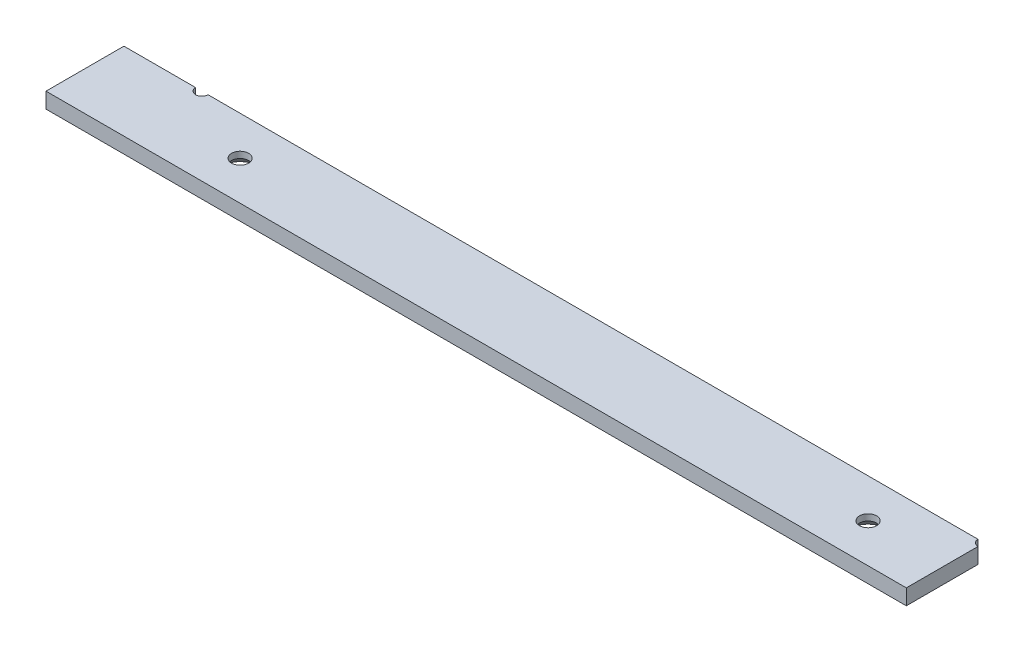
ISO-10303-21;
HEADER;
FILE_DESCRIPTION(('STEP AP214'),'2;1');
FILE_NAME('part.step','',(''),(''),'','','');
FILE_SCHEMA(('AUTOMOTIVE_DESIGN { 1 0 10303 214 1 1 1 1 }'));
ENDSEC;
DATA;
#1=APPLICATION_CONTEXT('core data for automotive mechanical design processes');
#2=APPLICATION_PROTOCOL_DEFINITION('international standard','automotive_design',2000,#1);
#3=PRODUCT_CONTEXT('',#1,'mechanical');
#4=PRODUCT('Part','Part','',(#3));
#5=PRODUCT_RELATED_PRODUCT_CATEGORY('part','',(#4));
#6=PRODUCT_DEFINITION_FORMATION('','',#4);
#7=PRODUCT_DEFINITION_CONTEXT('part definition',#1,'design');
#8=PRODUCT_DEFINITION('design','',#6,#7);
#9=PRODUCT_DEFINITION_SHAPE('','',#8);
#10=(LENGTH_UNIT() NAMED_UNIT(*) SI_UNIT(.MILLI.,.METRE.));
#11=(NAMED_UNIT(*) PLANE_ANGLE_UNIT() SI_UNIT($,.RADIAN.));
#12=(NAMED_UNIT(*) SI_UNIT($,.STERADIAN.) SOLID_ANGLE_UNIT());
#13=UNCERTAINTY_MEASURE_WITH_UNIT(LENGTH_MEASURE(1.E-05),#10,'distance_accuracy_value','');
#14=(GEOMETRIC_REPRESENTATION_CONTEXT(3) GLOBAL_UNCERTAINTY_ASSIGNED_CONTEXT((#13)) GLOBAL_UNIT_ASSIGNED_CONTEXT((#10,
#11,#12)) REPRESENTATION_CONTEXT('',''));
#15=CARTESIAN_POINT('',(0.,0.,0.));
#16=DIRECTION('',(0.,0.,1.));
#17=DIRECTION('',(1.,0.,0.));
#18=AXIS2_PLACEMENT_3D('',#15,#16,#17);
#19=CARTESIAN_POINT('',(0.,5.,-25.));
#20=DIRECTION('',(0.,0.,1.));
#21=DIRECTION('',(1.,0.,0.));
#22=AXIS2_PLACEMENT_3D('',#19,#20,#21);
#23=PLANE('',#22);
#24=DIRECTION('',(-1.,0.,0.));
#25=VECTOR('',#24,1.);
#26=CARTESIAN_POINT('',(0.,0.,-25.));
#27=LINE('',#26,#25);
#28=CARTESIAN_POINT('',(274.,0.,-25.));
#29=VERTEX_POINT('',#28);
#30=CARTESIAN_POINT('',(27.,0.,-25.));
#31=VERTEX_POINT('',#30);
#32=EDGE_CURVE('E110',#29,#31,#27,.T.);
#33=ORIENTED_EDGE('',*,*,#32,.T.);
#34=DIRECTION('',(0.,1.,0.));
#35=VECTOR('',#34,1.);
#36=CARTESIAN_POINT('',(27.,0.,-25.));
#37=LINE('',#36,#35);
#38=CARTESIAN_POINT('',(27.,5.,-25.));
#39=VERTEX_POINT('',#38);
#40=EDGE_CURVE('E48',#31,#39,#37,.T.);
#41=ORIENTED_EDGE('',*,*,#40,.T.);
#42=DIRECTION('',(-1.,0.,0.));
#43=VECTOR('',#42,1.);
#44=CARTESIAN_POINT('',(0.,5.,-25.));
#45=LINE('',#44,#43);
#46=CARTESIAN_POINT('',(274.,5.,-25.));
#47=VERTEX_POINT('',#46);
#48=EDGE_CURVE('E122',#47,#39,#45,.T.);
#49=ORIENTED_EDGE('',*,*,#48,.F.);
#50=DIRECTION('',(0.,1.,0.));
#51=VECTOR('',#50,1.);
#52=CARTESIAN_POINT('',(274.,0.,-25.));
#53=LINE('',#52,#51);
#54=EDGE_CURVE('E129',#47,#29,#53,.F.);
#55=ORIENTED_EDGE('',*,*,#54,.T.);
#56=EDGE_LOOP('',(#33,#41,#49,#55));
#57=FACE_BOUND('',#56,.T.);
#58=ADVANCED_FACE('F34',(#57),#23,.F.);
#59=CARTESIAN_POINT('',(0.,5.,0.));
#60=DIRECTION('',(1.,0.,0.));
#61=DIRECTION('',(0.,0.,-1.));
#62=AXIS2_PLACEMENT_3D('',#59,#60,#61);
#63=PLANE('',#62);
#64=DIRECTION('',(0.,0.,1.));
#65=VECTOR('',#64,1.);
#66=CARTESIAN_POINT('',(0.,0.,0.));
#67=LINE('',#66,#65);
#68=CARTESIAN_POINT('',(0.,0.,-25.));
#69=VERTEX_POINT('',#68);
#70=CARTESIAN_POINT('',(0.,0.,0.));
#71=VERTEX_POINT('',#70);
#72=EDGE_CURVE('E109',#69,#71,#67,.T.);
#73=ORIENTED_EDGE('',*,*,#72,.T.);
#74=DIRECTION('',(0.,-1.,0.));
#75=VECTOR('',#74,1.);
#76=CARTESIAN_POINT('',(0.,5.,0.));
#77=LINE('',#76,#75);
#78=CARTESIAN_POINT('',(0.,5.,0.));
#79=VERTEX_POINT('',#78);
#80=EDGE_CURVE('E125',#79,#71,#77,.T.);
#81=ORIENTED_EDGE('',*,*,#80,.F.);
#82=DIRECTION('',(0.,0.,1.));
#83=VECTOR('',#82,1.);
#84=CARTESIAN_POINT('',(0.,5.,0.));
#85=LINE('',#84,#83);
#86=CARTESIAN_POINT('',(0.,5.,-25.));
#87=VERTEX_POINT('',#86);
#88=EDGE_CURVE('E113',#87,#79,#85,.T.);
#89=ORIENTED_EDGE('',*,*,#88,.F.);
#90=DIRECTION('',(0.,-1.,0.));
#91=VECTOR('',#90,1.);
#92=CARTESIAN_POINT('',(0.,5.,-25.));
#93=LINE('',#92,#91);
#94=EDGE_CURVE('E119',#87,#69,#93,.T.);
#95=ORIENTED_EDGE('',*,*,#94,.T.);
#96=EDGE_LOOP('',(#73,#81,#89,#95));
#97=FACE_BOUND('',#96,.T.);
#98=ADVANCED_FACE('F36',(#97),#63,.F.);
#99=CARTESIAN_POINT('',(0.,5.,0.));
#100=DIRECTION('',(0.,0.,-1.));
#101=DIRECTION('',(-1.,0.,0.));
#102=AXIS2_PLACEMENT_3D('',#99,#100,#101);
#103=PLANE('',#102);
#104=DIRECTION('',(1.,0.,0.));
#105=VECTOR('',#104,1.);
#106=CARTESIAN_POINT('',(0.,0.,0.));
#107=LINE('',#106,#105);
#108=CARTESIAN_POINT('',(276.,0.,0.));
#109=VERTEX_POINT('',#108);
#110=EDGE_CURVE('E115',#71,#109,#107,.T.);
#111=ORIENTED_EDGE('',*,*,#110,.T.);
#112=DIRECTION('',(0.,-1.,0.));
#113=VECTOR('',#112,1.);
#114=CARTESIAN_POINT('',(276.,5.,0.));
#115=LINE('',#114,#113);
#116=CARTESIAN_POINT('',(276.,5.,0.));
#117=VERTEX_POINT('',#116);
#118=EDGE_CURVE('E121',#117,#109,#115,.T.);
#119=ORIENTED_EDGE('',*,*,#118,.F.);
#120=DIRECTION('',(1.,0.,0.));
#121=VECTOR('',#120,1.);
#122=CARTESIAN_POINT('',(0.,5.,0.));
#123=LINE('',#122,#121);
#124=EDGE_CURVE('E143',#79,#117,#123,.T.);
#125=ORIENTED_EDGE('',*,*,#124,.F.);
#126=ORIENTED_EDGE('',*,*,#80,.T.);
#127=EDGE_LOOP('',(#111,#119,#125,#126));
#128=FACE_BOUND('',#127,.T.);
#129=ADVANCED_FACE('F151',(#128),#103,.F.);
#130=CARTESIAN_POINT('',(276.,5.,0.));
#131=DIRECTION('',(-1.,0.,0.));
#132=DIRECTION('',(0.,0.,1.));
#133=AXIS2_PLACEMENT_3D('',#130,#131,#132);
#134=PLANE('',#133);
#135=DIRECTION('',(0.,0.,-1.));
#136=VECTOR('',#135,1.);
#137=CARTESIAN_POINT('',(276.,0.,0.));
#138=LINE('',#137,#136);
#139=CARTESIAN_POINT('',(276.,0.,-23.));
#140=VERTEX_POINT('',#139);
#141=EDGE_CURVE('E111',#109,#140,#138,.T.);
#142=ORIENTED_EDGE('',*,*,#141,.T.);
#143=DIRECTION('',(0.,1.,0.));
#144=VECTOR('',#143,1.);
#145=CARTESIAN_POINT('',(276.,0.,-23.));
#146=LINE('',#145,#144);
#147=CARTESIAN_POINT('',(276.,5.,-23.));
#148=VERTEX_POINT('',#147);
#149=EDGE_CURVE('E56',#140,#148,#146,.T.);
#150=ORIENTED_EDGE('',*,*,#149,.T.);
#151=DIRECTION('',(0.,0.,-1.));
#152=VECTOR('',#151,1.);
#153=CARTESIAN_POINT('',(276.,5.,0.));
#154=LINE('',#153,#152);
#155=EDGE_CURVE('E145',#117,#148,#154,.T.);
#156=ORIENTED_EDGE('',*,*,#155,.F.);
#157=ORIENTED_EDGE('',*,*,#118,.T.);
#158=EDGE_LOOP('',(#142,#150,#156,#157));
#159=FACE_BOUND('',#158,.T.);
#160=ADVANCED_FACE('F155',(#159),#134,.F.);
#161=CARTESIAN_POINT('',(23.,5.,-25.));
#162=VERTEX_POINT('',#161);
#163=EDGE_CURVE('E103',#162,#87,#45,.T.);
#164=ORIENTED_EDGE('',*,*,#163,.F.);
#165=DIRECTION('',(0.,1.,0.));
#166=VECTOR('',#165,1.);
#167=CARTESIAN_POINT('',(23.,0.,-25.));
#168=LINE('',#167,#166);
#169=CARTESIAN_POINT('',(23.,0.,-25.));
#170=VERTEX_POINT('',#169);
#171=EDGE_CURVE('E91',#162,#170,#168,.F.);
#172=ORIENTED_EDGE('',*,*,#171,.T.);
#173=EDGE_CURVE('E101',#170,#69,#27,.T.);
#174=ORIENTED_EDGE('',*,*,#173,.T.);
#175=ORIENTED_EDGE('',*,*,#94,.F.);
#176=EDGE_LOOP('',(#164,#172,#174,#175));
#177=FACE_BOUND('',#176,.T.);
#178=ADVANCED_FACE('F99',(#177),#23,.F.);
#179=CARTESIAN_POINT('',(0.,5.,0.));
#180=DIRECTION('',(0.,-1.,0.));
#181=DIRECTION('',(0.,0.,-1.));
#182=AXIS2_PLACEMENT_3D('',#179,#180,#181);
#183=PLANE('',#182);
#184=CARTESIAN_POINT('',(251.231218281358,5.,-12.5));
#185=DIRECTION('',(0.,-1.,0.));
#186=DIRECTION('',(0.,0.,-1.));
#187=AXIS2_PLACEMENT_3D('',#184,#185,#186);
#188=CIRCLE('',#187,2.74999999999997);
#189=CARTESIAN_POINT('',(251.231218281358,5.,-15.25));
#190=VERTEX_POINT('',#189);
#191=EDGE_CURVE('E278',#190,#190,#188,.T.);
#192=ORIENTED_EDGE('',*,*,#191,.T.);
#193=EDGE_LOOP('',(#192));
#194=FACE_BOUND('',#193,.T.);
#195=CARTESIAN_POINT('',(49.7687817186424,5.,-12.5));
#196=DIRECTION('',(0.,-1.,0.));
#197=DIRECTION('',(0.,0.,-1.));
#198=AXIS2_PLACEMENT_3D('',#195,#196,#197);
#199=CIRCLE('',#198,2.74999999999999);
#200=CARTESIAN_POINT('',(49.7687817186424,5.,-15.25));
#201=VERTEX_POINT('',#200);
#202=EDGE_CURVE('E281',#201,#201,#199,.T.);
#203=ORIENTED_EDGE('',*,*,#202,.T.);
#204=EDGE_LOOP('',(#203));
#205=FACE_BOUND('',#204,.T.);
#206=ORIENTED_EDGE('',*,*,#48,.T.);
#207=CARTESIAN_POINT('',(25.,5.,-25.));
#208=DIRECTION('',(0.,1.,0.));
#209=DIRECTION('',(0.,0.,1.));
#210=AXIS2_PLACEMENT_3D('',#207,#208,#209);
#211=CIRCLE('',#210,2.);
#212=EDGE_CURVE('E104',#162,#39,#211,.T.);
#213=ORIENTED_EDGE('',*,*,#212,.F.);
#214=ORIENTED_EDGE('',*,*,#163,.T.);
#215=ORIENTED_EDGE('',*,*,#88,.T.);
#216=ORIENTED_EDGE('',*,*,#124,.T.);
#217=ORIENTED_EDGE('',*,*,#155,.T.);
#218=CARTESIAN_POINT('',(276.,5.,-25.));
#219=DIRECTION('',(0.,1.,0.));
#220=DIRECTION('',(0.,0.,1.));
#221=AXIS2_PLACEMENT_3D('',#218,#219,#220);
#222=CIRCLE('',#221,2.);
#223=EDGE_CURVE('E135',#47,#148,#222,.T.);
#224=ORIENTED_EDGE('',*,*,#223,.F.);
#225=EDGE_LOOP('',(#206,#213,#214,#215,#216,#217,#224));
#226=FACE_BOUND('',#225,.T.);
#227=ADVANCED_FACE('F157',(#194,#205,#226),#183,.F.);
#228=CARTESIAN_POINT('',(0.,0.,0.));
#229=DIRECTION('',(0.,-1.,0.));
#230=DIRECTION('',(0.,0.,-1.));
#231=AXIS2_PLACEMENT_3D('',#228,#229,#230);
#232=PLANE('',#231);
#233=CARTESIAN_POINT('',(251.231218281358,0.,-12.5));
#234=DIRECTION('',(0.,-1.,0.));
#235=DIRECTION('',(0.,0.,-1.));
#236=AXIS2_PLACEMENT_3D('',#233,#234,#235);
#237=CIRCLE('',#236,5.73499999999999);
#238=CARTESIAN_POINT('',(251.231218281358,0.,-18.235));
#239=VERTEX_POINT('',#238);
#240=EDGE_CURVE('E272',#239,#239,#237,.T.);
#241=ORIENTED_EDGE('',*,*,#240,.F.);
#242=EDGE_LOOP('',(#241));
#243=FACE_BOUND('',#242,.T.);
#244=CARTESIAN_POINT('',(49.7687817186424,0.,-12.5));
#245=DIRECTION('',(0.,-1.,0.));
#246=DIRECTION('',(0.,0.,-1.));
#247=AXIS2_PLACEMENT_3D('',#244,#245,#246);
#248=CIRCLE('',#247,5.735);
#249=CARTESIAN_POINT('',(49.7687817186424,0.,-18.235));
#250=VERTEX_POINT('',#249);
#251=EDGE_CURVE('E275',#250,#250,#248,.T.);
#252=ORIENTED_EDGE('',*,*,#251,.F.);
#253=EDGE_LOOP('',(#252));
#254=FACE_BOUND('',#253,.T.);
#255=CARTESIAN_POINT('',(25.,0.,-25.));
#256=DIRECTION('',(0.,-1.,0.));
#257=DIRECTION('',(0.,0.,-1.));
#258=AXIS2_PLACEMENT_3D('',#255,#256,#257);
#259=CIRCLE('',#258,2.);
#260=EDGE_CURVE('E11',#31,#170,#259,.T.);
#261=ORIENTED_EDGE('',*,*,#260,.F.);
#262=ORIENTED_EDGE('',*,*,#32,.F.);
#263=CARTESIAN_POINT('',(276.,0.,-25.));
#264=DIRECTION('',(0.,-1.,0.));
#265=DIRECTION('',(0.,0.,-1.));
#266=AXIS2_PLACEMENT_3D('',#263,#264,#265);
#267=CIRCLE('',#266,2.);
#268=EDGE_CURVE('E42',#140,#29,#267,.T.);
#269=ORIENTED_EDGE('',*,*,#268,.F.);
#270=ORIENTED_EDGE('',*,*,#141,.F.);
#271=ORIENTED_EDGE('',*,*,#110,.F.);
#272=ORIENTED_EDGE('',*,*,#72,.F.);
#273=ORIENTED_EDGE('',*,*,#173,.F.);
#274=EDGE_LOOP('',(#261,#262,#269,#270,#271,#272,#273));
#275=FACE_BOUND('',#274,.T.);
#276=ADVANCED_FACE('F107',(#243,#254,#275),#232,.T.);
#277=CARTESIAN_POINT('',(276.,0.,-25.));
#278=DIRECTION('',(0.,1.,0.));
#279=DIRECTION('',(0.,0.,1.));
#280=AXIS2_PLACEMENT_3D('',#277,#278,#279);
#281=CYLINDRICAL_SURFACE('',#280,2.);
#282=ORIENTED_EDGE('',*,*,#268,.T.);
#283=ORIENTED_EDGE('',*,*,#54,.F.);
#284=ORIENTED_EDGE('',*,*,#223,.T.);
#285=ORIENTED_EDGE('',*,*,#149,.F.);
#286=EDGE_LOOP('',(#282,#283,#284,#285));
#287=FACE_BOUND('',#286,.T.);
#288=ADVANCED_FACE('F128',(#287),#281,.F.);
#289=CARTESIAN_POINT('',(25.,0.,-25.));
#290=DIRECTION('',(0.,1.,0.));
#291=DIRECTION('',(0.,0.,1.));
#292=AXIS2_PLACEMENT_3D('',#289,#290,#291);
#293=CYLINDRICAL_SURFACE('',#292,2.);
#294=ORIENTED_EDGE('',*,*,#260,.T.);
#295=ORIENTED_EDGE('',*,*,#171,.F.);
#296=ORIENTED_EDGE('',*,*,#212,.T.);
#297=ORIENTED_EDGE('',*,*,#40,.F.);
#298=EDGE_LOOP('',(#294,#295,#296,#297));
#299=FACE_BOUND('',#298,.T.);
#300=ADVANCED_FACE('F90',(#299),#293,.F.);
#301=CARTESIAN_POINT('',(49.7687817186424,0.,-12.5));
#302=DIRECTION('',(0.,-1.,0.));
#303=DIRECTION('',(0.,0.,-1.));
#304=AXIS2_PLACEMENT_3D('',#301,#302,#303);
#305=CYLINDRICAL_SURFACE('',#304,2.75);
#306=ORIENTED_EDGE('',*,*,#202,.F.);
#307=EDGE_LOOP('',(#306));
#308=FACE_BOUND('',#307,.T.);
#309=CARTESIAN_POINT('',(49.7687817186424,2.985,-12.5));
#310=DIRECTION('',(0.,-1.,0.));
#311=DIRECTION('',(0.,0.,-1.));
#312=AXIS2_PLACEMENT_3D('',#309,#310,#311);
#313=CIRCLE('',#312,2.75);
#314=CARTESIAN_POINT('',(49.7687817186424,2.985,-15.25));
#315=VERTEX_POINT('',#314);
#316=EDGE_CURVE('E277',#315,#315,#313,.T.);
#317=ORIENTED_EDGE('',*,*,#316,.T.);
#318=EDGE_LOOP('',(#317));
#319=FACE_BOUND('',#318,.T.);
#320=ADVANCED_FACE('F211',(#308,#319),#305,.F.);
#321=CARTESIAN_POINT('',(49.7687817186424,0.,-12.5));
#322=DIRECTION('',(0.,-1.,0.));
#323=DIRECTION('',(0.,0.,-1.));
#324=AXIS2_PLACEMENT_3D('',#321,#322,#323);
#325=CONICAL_SURFACE('',#324,5.735,0.785398163397448);
#326=ORIENTED_EDGE('',*,*,#316,.F.);
#327=EDGE_LOOP('',(#326));
#328=FACE_BOUND('',#327,.T.);
#329=ORIENTED_EDGE('',*,*,#251,.T.);
#330=EDGE_LOOP('',(#329));
#331=FACE_BOUND('',#330,.T.);
#332=ADVANCED_FACE('F220',(#328,#331),#325,.F.);
#333=CARTESIAN_POINT('',(251.231218281358,0.,-12.5));
#334=DIRECTION('',(0.,-1.,0.));
#335=DIRECTION('',(0.,0.,-1.));
#336=AXIS2_PLACEMENT_3D('',#333,#334,#335);
#337=CYLINDRICAL_SURFACE('',#336,2.74999999999997);
#338=ORIENTED_EDGE('',*,*,#191,.F.);
#339=EDGE_LOOP('',(#338));
#340=FACE_BOUND('',#339,.T.);
#341=CARTESIAN_POINT('',(251.231218281358,2.985,-12.5));
#342=DIRECTION('',(0.,-1.,0.));
#343=DIRECTION('',(0.,0.,-1.));
#344=AXIS2_PLACEMENT_3D('',#341,#342,#343);
#345=CIRCLE('',#344,2.74999999999997);
#346=CARTESIAN_POINT('',(251.231218281358,2.985,-15.25));
#347=VERTEX_POINT('',#346);
#348=EDGE_CURVE('E284',#347,#347,#345,.T.);
#349=ORIENTED_EDGE('',*,*,#348,.T.);
#350=EDGE_LOOP('',(#349));
#351=FACE_BOUND('',#350,.T.);
#352=ADVANCED_FACE('F229',(#340,#351),#337,.F.);
#353=CARTESIAN_POINT('',(251.231218281358,0.,-12.5));
#354=DIRECTION('',(0.,-1.,0.));
#355=DIRECTION('',(0.,0.,-1.));
#356=AXIS2_PLACEMENT_3D('',#353,#354,#355);
#357=CONICAL_SURFACE('',#356,5.73499999999999,0.78539816339745);
#358=ORIENTED_EDGE('',*,*,#348,.F.);
#359=EDGE_LOOP('',(#358));
#360=FACE_BOUND('',#359,.T.);
#361=ORIENTED_EDGE('',*,*,#240,.T.);
#362=EDGE_LOOP('',(#361));
#363=FACE_BOUND('',#362,.T.);
#364=ADVANCED_FACE('F238',(#360,#363),#357,.F.);
#365=CLOSED_SHELL('',(#58,#98,#129,#160,#178,#227,#276,#288,#300,#320,#332,#352,#364));
#366=MANIFOLD_SOLID_BREP('B2',#365);
#367=ADVANCED_BREP_SHAPE_REPRESENTATION('',(#18,#366),#14);
#368=SHAPE_DEFINITION_REPRESENTATION(#9,#367);
ENDSEC;
END-ISO-10303-21;
